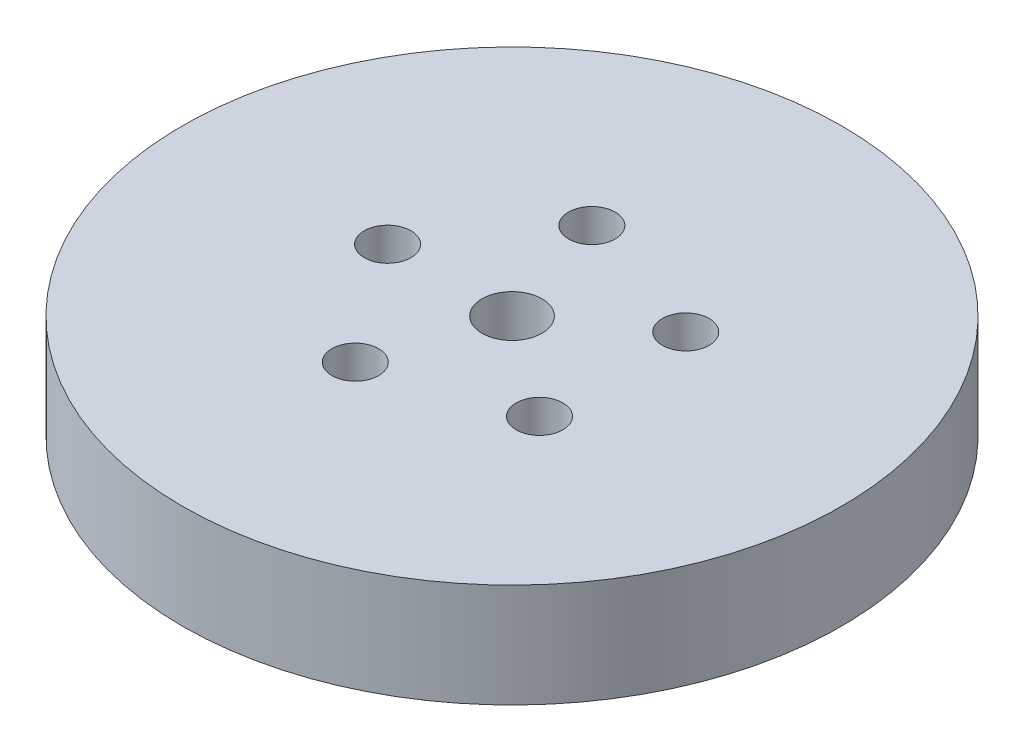
ISO-10303-21;
HEADER;
FILE_DESCRIPTION(('STEP AP214'),'2;1');
FILE_NAME('part.step','',(''),(''),'','','');
FILE_SCHEMA(('AUTOMOTIVE_DESIGN { 1 0 10303 214 1 1 1 1 }'));
ENDSEC;
DATA;
#1=APPLICATION_CONTEXT('core data for automotive mechanical design processes');
#2=APPLICATION_PROTOCOL_DEFINITION('international standard','automotive_design',2000,#1);
#3=PRODUCT_CONTEXT('',#1,'mechanical');
#4=PRODUCT('Part','Part','',(#3));
#5=PRODUCT_RELATED_PRODUCT_CATEGORY('part','',(#4));
#6=PRODUCT_DEFINITION_FORMATION('','',#4);
#7=PRODUCT_DEFINITION_CONTEXT('part definition',#1,'design');
#8=PRODUCT_DEFINITION('design','',#6,#7);
#9=PRODUCT_DEFINITION_SHAPE('','',#8);
#10=(LENGTH_UNIT() NAMED_UNIT(*) SI_UNIT(.MILLI.,.METRE.));
#11=(NAMED_UNIT(*) PLANE_ANGLE_UNIT() SI_UNIT($,.RADIAN.));
#12=(NAMED_UNIT(*) SI_UNIT($,.STERADIAN.) SOLID_ANGLE_UNIT());
#13=UNCERTAINTY_MEASURE_WITH_UNIT(LENGTH_MEASURE(1.E-05),#10,'distance_accuracy_value','');
#14=(GEOMETRIC_REPRESENTATION_CONTEXT(3) GLOBAL_UNCERTAINTY_ASSIGNED_CONTEXT((#13)) GLOBAL_UNIT_ASSIGNED_CONTEXT((#10,
#11,#12)) REPRESENTATION_CONTEXT('',''));
#15=CARTESIAN_POINT('',(0.,0.,0.));
#16=DIRECTION('',(0.,0.,1.));
#17=DIRECTION('',(1.,0.,0.));
#18=AXIS2_PLACEMENT_3D('',#15,#16,#17);
#19=CARTESIAN_POINT('',(0.,26.,0.));
#20=DIRECTION('',(0.,-1.,0.));
#21=DIRECTION('',(0.,0.,-1.));
#22=AXIS2_PLACEMENT_3D('',#19,#20,#21);
#23=CYLINDRICAL_SURFACE('',#22,82.5);
#24=CARTESIAN_POINT('',(0.,26.,0.));
#25=DIRECTION('',(0.,1.,0.));
#26=DIRECTION('',(0.,0.,1.));
#27=AXIS2_PLACEMENT_3D('',#24,#25,#26);
#28=CIRCLE('',#27,82.5);
#29=CARTESIAN_POINT('',(0.,26.,-82.5));
#30=VERTEX_POINT('',#29);
#31=EDGE_CURVE('E10',#30,#30,#28,.T.);
#32=CARTESIAN_POINT('',(0.,0.,0.));
#33=DIRECTION('',(0.,1.,0.));
#34=DIRECTION('',(0.,0.,1.));
#35=AXIS2_PLACEMENT_3D('',#32,#33,#34);
#36=CIRCLE('',#35,82.5);
#37=CARTESIAN_POINT('',(0.,0.,-82.5));
#38=VERTEX_POINT('',#37);
#39=EDGE_CURVE('E37',#38,#38,#36,.T.);
#40=CARTESIAN_POINT('',(0.,26.,-82.5));
#41=CARTESIAN_POINT('',(0.,25.7291666666667,-82.5));
#42=CARTESIAN_POINT('',(0.,25.4583333333333,-82.5));
#43=CARTESIAN_POINT('',(0.,24.9166666666667,-82.5));
#44=CARTESIAN_POINT('',(0.,24.6458333333333,-82.5));
#45=CARTESIAN_POINT('',(0.,24.1041666666667,-82.5));
#46=CARTESIAN_POINT('',(0.,23.8333333333333,-82.5));
#47=CARTESIAN_POINT('',(0.,23.2916666666667,-82.5));
#48=CARTESIAN_POINT('',(0.,23.0208333333333,-82.5));
#49=CARTESIAN_POINT('',(0.,22.4791666666667,-82.5));
#50=CARTESIAN_POINT('',(0.,22.2083333333333,-82.5));
#51=CARTESIAN_POINT('',(0.,21.6666666666667,-82.5));
#52=CARTESIAN_POINT('',(0.,21.3958333333333,-82.5));
#53=CARTESIAN_POINT('',(0.,20.8541666666667,-82.5));
#54=CARTESIAN_POINT('',(0.,20.5833333333333,-82.5));
#55=CARTESIAN_POINT('',(0.,20.0416666666667,-82.5));
#56=CARTESIAN_POINT('',(0.,19.7708333333333,-82.5));
#57=CARTESIAN_POINT('',(0.,19.2291666666667,-82.5));
#58=CARTESIAN_POINT('',(0.,18.9583333333333,-82.5));
#59=CARTESIAN_POINT('',(0.,18.4166666666667,-82.5));
#60=CARTESIAN_POINT('',(0.,18.1458333333333,-82.5));
#61=CARTESIAN_POINT('',(0.,17.6041666666667,-82.5));
#62=CARTESIAN_POINT('',(0.,17.3333333333333,-82.5));
#63=CARTESIAN_POINT('',(0.,16.7916666666667,-82.5));
#64=CARTESIAN_POINT('',(0.,16.5208333333333,-82.5));
#65=CARTESIAN_POINT('',(0.,15.9791666666667,-82.5));
#66=CARTESIAN_POINT('',(0.,15.7083333333333,-82.5));
#67=CARTESIAN_POINT('',(0.,15.1666666666667,-82.5));
#68=CARTESIAN_POINT('',(0.,14.8958333333333,-82.5));
#69=CARTESIAN_POINT('',(0.,14.3541666666667,-82.5));
#70=CARTESIAN_POINT('',(0.,14.0833333333333,-82.5));
#71=CARTESIAN_POINT('',(0.,13.5416666666667,-82.5));
#72=CARTESIAN_POINT('',(0.,13.2708333333333,-82.5));
#73=CARTESIAN_POINT('',(0.,12.7291666666667,-82.5));
#74=CARTESIAN_POINT('',(0.,12.4583333333333,-82.5));
#75=CARTESIAN_POINT('',(0.,11.9166666666667,-82.5));
#76=CARTESIAN_POINT('',(0.,11.6458333333333,-82.5));
#77=CARTESIAN_POINT('',(0.,11.1041666666667,-82.5));
#78=CARTESIAN_POINT('',(0.,10.8333333333333,-82.5));
#79=CARTESIAN_POINT('',(0.,10.2916666666667,-82.5));
#80=CARTESIAN_POINT('',(0.,10.0208333333333,-82.5));
#81=CARTESIAN_POINT('',(0.,9.47916666666667,-82.5));
#82=CARTESIAN_POINT('',(0.,9.20833333333333,-82.5));
#83=CARTESIAN_POINT('',(0.,8.66666666666667,-82.5));
#84=CARTESIAN_POINT('',(0.,8.39583333333333,-82.5));
#85=CARTESIAN_POINT('',(0.,7.85416666666667,-82.5));
#86=CARTESIAN_POINT('',(0.,7.58333333333333,-82.5));
#87=CARTESIAN_POINT('',(0.,7.04166666666667,-82.5));
#88=CARTESIAN_POINT('',(0.,6.77083333333333,-82.5));
#89=CARTESIAN_POINT('',(0.,6.22916666666667,-82.5));
#90=CARTESIAN_POINT('',(0.,5.95833333333333,-82.5));
#91=CARTESIAN_POINT('',(0.,5.41666666666667,-82.5));
#92=CARTESIAN_POINT('',(0.,5.14583333333333,-82.5));
#93=CARTESIAN_POINT('',(0.,4.60416666666667,-82.5));
#94=CARTESIAN_POINT('',(0.,4.33333333333333,-82.5));
#95=CARTESIAN_POINT('',(0.,3.79166666666667,-82.5));
#96=CARTESIAN_POINT('',(0.,3.52083333333333,-82.5));
#97=CARTESIAN_POINT('',(0.,2.97916666666667,-82.5));
#98=CARTESIAN_POINT('',(0.,2.70833333333333,-82.5));
#99=CARTESIAN_POINT('',(0.,2.16666666666667,-82.5));
#100=CARTESIAN_POINT('',(0.,1.89583333333333,-82.5));
#101=CARTESIAN_POINT('',(0.,1.35416666666667,-82.5));
#102=CARTESIAN_POINT('',(0.,1.08333333333333,-82.5));
#103=CARTESIAN_POINT('',(0.,0.541666666666667,-82.5));
#104=CARTESIAN_POINT('',(0.,0.270833333333334,-82.5));
#105=CARTESIAN_POINT('',(0.,0.,-82.5));
#106=B_SPLINE_CURVE_WITH_KNOTS('',3,(#40,#41,#42,#43,#44,#45,#46,#47,#48,#49,#50,#51,#52,#53,
#54,#55,#56,#57,#58,#59,#60,#61,#62,#63,#64,#65,#66,#67,#68,#69,#70,#71,#72,#73,#74,#75,#76,#77,
#78,#79,#80,#81,#82,#83,#84,#85,#86,#87,#88,#89,#90,#91,#92,#93,#94,#95,#96,#97,#98,#99,#100,
#101,#102,#103,#104,#105),.UNSPECIFIED.,.F.,.F.,(4,2,2,2,2,2,2,2,2,2,2,2,2,2,2,2,2,2,2,2,2,2,2,
2,2,2,2,2,2,2,2,2,4),(0.,0.812500000000001,1.625,2.4375,3.25,4.0625,4.875,5.6875,6.5,7.3125,
8.125,8.9375,9.75,10.5625,11.375,12.1875,13.,13.8125,14.625,15.4375,16.25,17.0625,17.875,
18.6875,19.5,20.3125,21.125,21.9375,22.75,23.5625,24.375,25.1875,26.),.UNSPECIFIED.);
#107=EDGE_CURVE('BSEAM40',#30,#38,#106,.T.);
#108=ORIENTED_EDGE('',*,*,#31,.F.);
#109=ORIENTED_EDGE('',*,*,#39,.T.);
#110=ORIENTED_EDGE('',*,*,#107,.T.);
#111=ORIENTED_EDGE('',*,*,#107,.F.);
#112=EDGE_LOOP('',(#108,#110,#109,#111));
#113=FACE_BOUND('',#112,.T.);
#114=ADVANCED_FACE('F40',(#113),#23,.T.);
#115=CARTESIAN_POINT('',(0.,26.,0.));
#116=DIRECTION('',(0.,1.,0.));
#117=DIRECTION('',(0.,0.,1.));
#118=AXIS2_PLACEMENT_3D('',#115,#116,#117);
#119=PLANE('',#118);
#120=CARTESIAN_POINT('',(-9.62234964400374,26.,-29.6145470882933));
#121=DIRECTION('',(0.,1.,0.));
#122=DIRECTION('',(-0.95105651629515,0.,0.309016994374958));
#123=AXIS2_PLACEMENT_3D('',#120,#121,#122);
#124=CIRCLE('',#123,5.84834959047401);
#125=CARTESIAN_POINT('',(-15.1844606315961,26.,-27.807307675791));
#126=VERTEX_POINT('',#125);
#127=EDGE_CURVE('E70',#126,#126,#124,.T.);
#128=ORIENTED_EDGE('',*,*,#127,.F.);
#129=EDGE_LOOP('',(#128));
#130=FACE_BOUND('',#129,.T.);
#131=CARTESIAN_POINT('',(25.1916384196362,26.,-18.3027966619998));
#132=DIRECTION('',(0.,1.,0.));
#133=DIRECTION('',(-0.58778525229248,0.,-0.809016994374942));
#134=AXIS2_PLACEMENT_3D('',#131,#132,#133);
#135=CIRCLE('',#134,5.84834959047401);
#136=CARTESIAN_POINT('',(21.7540647801048,26.,-23.034210869739));
#137=VERTEX_POINT('',#136);
#138=EDGE_CURVE('E71',#137,#137,#135,.T.);
#139=ORIENTED_EDGE('',*,*,#138,.F.);
#140=EDGE_LOOP('',(#139));
#141=FACE_BOUND('',#140,.T.);
#142=CARTESIAN_POINT('',(25.1916384196365,26.,18.3027966619994));
#143=DIRECTION('',(0.,1.,0.));
#144=DIRECTION('',(0.587785252292469,0.,-0.809016994374951));
#145=AXIS2_PLACEMENT_3D('',#142,#143,#144);
#146=CIRCLE('',#145,5.84834959047401);
#147=CARTESIAN_POINT('',(28.6292120591678,26.,13.5713824542602));
#148=VERTEX_POINT('',#147);
#149=EDGE_CURVE('E78',#148,#148,#146,.T.);
#150=ORIENTED_EDGE('',*,*,#149,.F.);
#151=EDGE_LOOP('',(#150));
#152=FACE_BOUND('',#151,.T.);
#153=CARTESIAN_POINT('',(-9.62234964400332,26.,29.6145470882935));
#154=DIRECTION('',(0.,1.,0.));
#155=DIRECTION('',(0.951056516295155,0.,0.309016994374945));
#156=AXIS2_PLACEMENT_3D('',#153,#154,#155);
#157=CIRCLE('',#156,5.84834959047401);
#158=CARTESIAN_POINT('',(-4.06023865641092,26.,31.4217865007957));
#159=VERTEX_POINT('',#158);
#160=EDGE_CURVE('E61',#159,#159,#157,.T.);
#161=ORIENTED_EDGE('',*,*,#160,.F.);
#162=EDGE_LOOP('',(#161));
#163=FACE_BOUND('',#162,.T.);
#164=CARTESIAN_POINT('',(-31.1385775512659,26.,0.));
#165=DIRECTION('',(0.,1.,0.));
#166=DIRECTION('',(0.,0.,1.));
#167=AXIS2_PLACEMENT_3D('',#164,#165,#166);
#168=CIRCLE('',#167,5.84834959047401);
#169=CARTESIAN_POINT('',(-31.1385775512659,26.,5.84834959047401));
#170=VERTEX_POINT('',#169);
#171=EDGE_CURVE('E54',#170,#170,#168,.T.);
#172=ORIENTED_EDGE('',*,*,#171,.F.);
#173=EDGE_LOOP('',(#172));
#174=FACE_BOUND('',#173,.T.);
#175=CARTESIAN_POINT('',(0.,26.,0.));
#176=DIRECTION('',(0.,1.,0.));
#177=DIRECTION('',(0.,0.,1.));
#178=AXIS2_PLACEMENT_3D('',#175,#176,#177);
#179=CIRCLE('',#178,7.5);
#180=CARTESIAN_POINT('',(0.,26.,-7.5));
#181=VERTEX_POINT('',#180);
#182=EDGE_CURVE('E50',#181,#181,#179,.T.);
#183=ORIENTED_EDGE('',*,*,#182,.F.);
#184=EDGE_LOOP('',(#183));
#185=FACE_BOUND('',#184,.T.);
#186=ORIENTED_EDGE('',*,*,#31,.T.);
#187=EDGE_LOOP('',(#186));
#188=FACE_BOUND('',#187,.T.);
#189=ADVANCED_FACE('F94',(#130,#141,#152,#163,#174,#185,#188),#119,.T.);
#190=CARTESIAN_POINT('',(0.,0.,0.));
#191=DIRECTION('',(0.,1.,0.));
#192=DIRECTION('',(0.,0.,1.));
#193=AXIS2_PLACEMENT_3D('',#190,#191,#192);
#194=PLANE('',#193);
#195=CARTESIAN_POINT('',(0.,0.,0.));
#196=DIRECTION('',(0.,1.,0.));
#197=DIRECTION('',(0.,0.,1.));
#198=AXIS2_PLACEMENT_3D('',#195,#196,#197);
#199=CIRCLE('',#198,7.5);
#200=CARTESIAN_POINT('',(0.,0.,-7.5));
#201=VERTEX_POINT('',#200);
#202=EDGE_CURVE('E47',#201,#201,#199,.T.);
#203=ORIENTED_EDGE('',*,*,#202,.T.);
#204=EDGE_LOOP('',(#203));
#205=FACE_BOUND('',#204,.T.);
#206=ORIENTED_EDGE('',*,*,#39,.F.);
#207=EDGE_LOOP('',(#206));
#208=FACE_BOUND('',#207,.T.);
#209=ADVANCED_FACE('F100',(#205,#208),#194,.F.);
#210=CARTESIAN_POINT('',(0.,26.,0.));
#211=DIRECTION('',(0.,-1.,0.));
#212=DIRECTION('',(0.,0.,-1.));
#213=AXIS2_PLACEMENT_3D('',#210,#211,#212);
#214=CYLINDRICAL_SURFACE('',#213,7.5);
#215=CARTESIAN_POINT('',(0.,26.,-7.5));
#216=CARTESIAN_POINT('',(0.,25.7291666666667,-7.5));
#217=CARTESIAN_POINT('',(0.,25.4583333333333,-7.5));
#218=CARTESIAN_POINT('',(0.,24.9166666666667,-7.5));
#219=CARTESIAN_POINT('',(0.,24.6458333333333,-7.5));
#220=CARTESIAN_POINT('',(0.,24.1041666666667,-7.5));
#221=CARTESIAN_POINT('',(0.,23.8333333333333,-7.5));
#222=CARTESIAN_POINT('',(0.,23.2916666666667,-7.5));
#223=CARTESIAN_POINT('',(0.,23.0208333333333,-7.5));
#224=CARTESIAN_POINT('',(0.,22.4791666666667,-7.5));
#225=CARTESIAN_POINT('',(0.,22.2083333333333,-7.5));
#226=CARTESIAN_POINT('',(0.,21.6666666666667,-7.5));
#227=CARTESIAN_POINT('',(0.,21.3958333333333,-7.5));
#228=CARTESIAN_POINT('',(0.,20.8541666666667,-7.5));
#229=CARTESIAN_POINT('',(0.,20.5833333333333,-7.5));
#230=CARTESIAN_POINT('',(0.,20.0416666666667,-7.5));
#231=CARTESIAN_POINT('',(0.,19.7708333333333,-7.5));
#232=CARTESIAN_POINT('',(0.,19.2291666666667,-7.5));
#233=CARTESIAN_POINT('',(0.,18.9583333333333,-7.5));
#234=CARTESIAN_POINT('',(0.,18.4166666666667,-7.5));
#235=CARTESIAN_POINT('',(0.,18.1458333333333,-7.5));
#236=CARTESIAN_POINT('',(0.,17.6041666666667,-7.5));
#237=CARTESIAN_POINT('',(0.,17.3333333333333,-7.5));
#238=CARTESIAN_POINT('',(0.,16.7916666666667,-7.5));
#239=CARTESIAN_POINT('',(0.,16.5208333333333,-7.5));
#240=CARTESIAN_POINT('',(0.,15.9791666666667,-7.5));
#241=CARTESIAN_POINT('',(0.,15.7083333333333,-7.5));
#242=CARTESIAN_POINT('',(0.,15.1666666666667,-7.5));
#243=CARTESIAN_POINT('',(0.,14.8958333333333,-7.5));
#244=CARTESIAN_POINT('',(0.,14.3541666666667,-7.5));
#245=CARTESIAN_POINT('',(0.,14.0833333333333,-7.5));
#246=CARTESIAN_POINT('',(0.,13.5416666666667,-7.5));
#247=CARTESIAN_POINT('',(0.,13.2708333333333,-7.5));
#248=CARTESIAN_POINT('',(0.,12.7291666666667,-7.5));
#249=CARTESIAN_POINT('',(0.,12.4583333333333,-7.5));
#250=CARTESIAN_POINT('',(0.,11.9166666666667,-7.5));
#251=CARTESIAN_POINT('',(0.,11.6458333333333,-7.5));
#252=CARTESIAN_POINT('',(0.,11.1041666666667,-7.5));
#253=CARTESIAN_POINT('',(0.,10.8333333333333,-7.5));
#254=CARTESIAN_POINT('',(0.,10.2916666666667,-7.5));
#255=CARTESIAN_POINT('',(0.,10.0208333333333,-7.5));
#256=CARTESIAN_POINT('',(0.,9.47916666666667,-7.5));
#257=CARTESIAN_POINT('',(0.,9.20833333333333,-7.5));
#258=CARTESIAN_POINT('',(0.,8.66666666666667,-7.5));
#259=CARTESIAN_POINT('',(0.,8.39583333333333,-7.5));
#260=CARTESIAN_POINT('',(0.,7.85416666666667,-7.5));
#261=CARTESIAN_POINT('',(0.,7.58333333333333,-7.5));
#262=CARTESIAN_POINT('',(0.,7.04166666666667,-7.5));
#263=CARTESIAN_POINT('',(0.,6.77083333333333,-7.5));
#264=CARTESIAN_POINT('',(0.,6.22916666666667,-7.5));
#265=CARTESIAN_POINT('',(0.,5.95833333333333,-7.5));
#266=CARTESIAN_POINT('',(0.,5.41666666666667,-7.5));
#267=CARTESIAN_POINT('',(0.,5.14583333333333,-7.5));
#268=CARTESIAN_POINT('',(0.,4.60416666666667,-7.5));
#269=CARTESIAN_POINT('',(0.,4.33333333333333,-7.5));
#270=CARTESIAN_POINT('',(0.,3.79166666666667,-7.5));
#271=CARTESIAN_POINT('',(0.,3.52083333333333,-7.5));
#272=CARTESIAN_POINT('',(0.,2.97916666666667,-7.5));
#273=CARTESIAN_POINT('',(0.,2.70833333333333,-7.5));
#274=CARTESIAN_POINT('',(0.,2.16666666666667,-7.5));
#275=CARTESIAN_POINT('',(0.,1.89583333333333,-7.5));
#276=CARTESIAN_POINT('',(0.,1.35416666666667,-7.5));
#277=CARTESIAN_POINT('',(0.,1.08333333333333,-7.5));
#278=CARTESIAN_POINT('',(0.,0.541666666666667,-7.5));
#279=CARTESIAN_POINT('',(0.,0.270833333333334,-7.5));
#280=CARTESIAN_POINT('',(0.,0.,-7.5));
#281=B_SPLINE_CURVE_WITH_KNOTS('',3,(#215,#216,#217,#218,#219,#220,#221,#222,#223,#224,#225,
#226,#227,#228,#229,#230,#231,#232,#233,#234,#235,#236,#237,#238,#239,#240,#241,#242,#243,#244,
#245,#246,#247,#248,#249,#250,#251,#252,#253,#254,#255,#256,#257,#258,#259,#260,#261,#262,#263,
#264,#265,#266,#267,#268,#269,#270,#271,#272,#273,#274,#275,#276,#277,#278,#279,#280),
.UNSPECIFIED.,.F.,.F.,(4,2,2,2,2,2,2,2,2,2,2,2,2,2,2,2,2,2,2,2,2,2,2,2,2,2,2,2,2,2,2,2,4),(0.,
0.812499999999997,1.625,2.4375,3.25,4.0625,4.875,5.6875,6.5,7.3125,8.125,8.93749999999999,
9.74999999999999,10.5625,11.375,12.1875,13.,13.8125,14.625,15.4375,16.25,17.0625,17.875,18.6875,
19.5,20.3125,21.125,21.9375,22.75,23.5625,24.375,25.1875,26.),.UNSPECIFIED.);
#282=EDGE_CURVE('BSEAM106',#181,#201,#281,.T.);
#283=ORIENTED_EDGE('',*,*,#182,.T.);
#284=ORIENTED_EDGE('',*,*,#202,.F.);
#285=ORIENTED_EDGE('',*,*,#282,.T.);
#286=ORIENTED_EDGE('',*,*,#282,.F.);
#287=EDGE_LOOP('',(#283,#285,#284,#286));
#288=FACE_BOUND('',#287,.T.);
#289=ADVANCED_FACE('F106',(#288),#214,.F.);
#290=CARTESIAN_POINT('',(-31.1385775512659,4.80085496877086,0.));
#291=DIRECTION('',(0.,1.,0.));
#292=DIRECTION('',(0.,0.,1.));
#293=AXIS2_PLACEMENT_3D('',#290,#291,#292);
#294=CYLINDRICAL_SURFACE('',#293,5.84834959047401);
#295=CARTESIAN_POINT('',(-31.1385775512659,4.80085496877086,0.));
#296=DIRECTION('',(0.,1.,0.));
#297=DIRECTION('',(0.,0.,1.));
#298=AXIS2_PLACEMENT_3D('',#295,#296,#297);
#299=CIRCLE('',#298,5.84834959047401);
#300=CARTESIAN_POINT('',(-31.1385775512659,4.80085496877086,5.84834959047401));
#301=VERTEX_POINT('',#300);
#302=EDGE_CURVE('E55',#301,#301,#299,.T.);
#303=ORIENTED_EDGE('',*,*,#302,.F.);
#304=EDGE_LOOP('',(#303));
#305=FACE_BOUND('',#304,.T.);
#306=ORIENTED_EDGE('',*,*,#171,.T.);
#307=EDGE_LOOP('',(#306));
#308=FACE_BOUND('',#307,.T.);
#309=ADVANCED_FACE('F108',(#305,#308),#294,.F.);
#310=CARTESIAN_POINT('',(-31.1385775512659,4.80085496877086,0.));
#311=DIRECTION('',(0.,1.,0.));
#312=DIRECTION('',(0.,0.,1.));
#313=AXIS2_PLACEMENT_3D('',#310,#311,#312);
#314=PLANE('',#313);
#315=ORIENTED_EDGE('',*,*,#302,.T.);
#316=EDGE_LOOP('',(#315));
#317=FACE_BOUND('',#316,.T.);
#318=ADVANCED_FACE('F138',(#317),#314,.T.);
#319=CARTESIAN_POINT('',(-9.62234964400332,4.80085496877086,29.6145470882935));
#320=DIRECTION('',(0.,1.,0.));
#321=DIRECTION('',(0.,0.,1.));
#322=AXIS2_PLACEMENT_3D('',#319,#320,#321);
#323=CYLINDRICAL_SURFACE('',#322,5.84834959047401);
#324=CARTESIAN_POINT('',(-9.62234964400332,4.80085496877086,29.6145470882935));
#325=DIRECTION('',(0.,1.,0.));
#326=DIRECTION('',(0.951056516295155,0.,0.309016994374945));
#327=AXIS2_PLACEMENT_3D('',#324,#325,#326);
#328=CIRCLE('',#327,5.84834959047401);
#329=CARTESIAN_POINT('',(-4.06023865641092,4.80085496877086,31.4217865007957));
#330=VERTEX_POINT('',#329);
#331=EDGE_CURVE('E59',#330,#330,#328,.T.);
#332=ORIENTED_EDGE('',*,*,#331,.F.);
#333=EDGE_LOOP('',(#332));
#334=FACE_BOUND('',#333,.T.);
#335=ORIENTED_EDGE('',*,*,#160,.T.);
#336=EDGE_LOOP('',(#335));
#337=FACE_BOUND('',#336,.T.);
#338=ADVANCED_FACE('F150',(#334,#337),#323,.F.);
#339=CARTESIAN_POINT('',(-9.62234964400332,4.80085496877086,29.6145470882935));
#340=DIRECTION('',(0.,1.,0.));
#341=DIRECTION('',(0.951056516295155,0.,0.309016994374945));
#342=AXIS2_PLACEMENT_3D('',#339,#340,#341);
#343=PLANE('',#342);
#344=ORIENTED_EDGE('',*,*,#331,.T.);
#345=EDGE_LOOP('',(#344));
#346=FACE_BOUND('',#345,.T.);
#347=ADVANCED_FACE('F89',(#346),#343,.T.);
#348=CARTESIAN_POINT('',(25.1916384196365,4.80085496877086,18.3027966619994));
#349=DIRECTION('',(0.,1.,0.));
#350=DIRECTION('',(0.,0.,1.));
#351=AXIS2_PLACEMENT_3D('',#348,#349,#350);
#352=CYLINDRICAL_SURFACE('',#351,5.84834959047401);
#353=CARTESIAN_POINT('',(25.1916384196365,4.80085496877086,18.3027966619994));
#354=DIRECTION('',(0.,1.,0.));
#355=DIRECTION('',(0.587785252292469,0.,-0.809016994374951));
#356=AXIS2_PLACEMENT_3D('',#353,#354,#355);
#357=CIRCLE('',#356,5.84834959047401);
#358=CARTESIAN_POINT('',(28.6292120591678,4.80085496877086,13.5713824542602));
#359=VERTEX_POINT('',#358);
#360=EDGE_CURVE('E63',#359,#359,#357,.T.);
#361=ORIENTED_EDGE('',*,*,#360,.F.);
#362=EDGE_LOOP('',(#361));
#363=FACE_BOUND('',#362,.T.);
#364=ORIENTED_EDGE('',*,*,#149,.T.);
#365=EDGE_LOOP('',(#364));
#366=FACE_BOUND('',#365,.T.);
#367=ADVANCED_FACE('F87',(#363,#366),#352,.F.);
#368=CARTESIAN_POINT('',(25.1916384196365,4.80085496877086,18.3027966619994));
#369=DIRECTION('',(0.,1.,0.));
#370=DIRECTION('',(0.587785252292469,0.,-0.809016994374951));
#371=AXIS2_PLACEMENT_3D('',#368,#369,#370);
#372=PLANE('',#371);
#373=ORIENTED_EDGE('',*,*,#360,.T.);
#374=EDGE_LOOP('',(#373));
#375=FACE_BOUND('',#374,.T.);
#376=ADVANCED_FACE('F84',(#375),#372,.T.);
#377=CARTESIAN_POINT('',(25.1916384196362,4.80085496877086,-18.3027966619998));
#378=DIRECTION('',(0.,1.,0.));
#379=DIRECTION('',(0.,0.,1.));
#380=AXIS2_PLACEMENT_3D('',#377,#378,#379);
#381=CYLINDRICAL_SURFACE('',#380,5.84834959047401);
#382=CARTESIAN_POINT('',(25.1916384196362,4.80085496877086,-18.3027966619998));
#383=DIRECTION('',(0.,1.,0.));
#384=DIRECTION('',(-0.58778525229248,0.,-0.809016994374942));
#385=AXIS2_PLACEMENT_3D('',#382,#383,#384);
#386=CIRCLE('',#385,5.84834959047401);
#387=CARTESIAN_POINT('',(21.7540647801048,4.80085496877086,-23.034210869739));
#388=VERTEX_POINT('',#387);
#389=EDGE_CURVE('E76',#388,#388,#386,.T.);
#390=ORIENTED_EDGE('',*,*,#389,.F.);
#391=EDGE_LOOP('',(#390));
#392=FACE_BOUND('',#391,.T.);
#393=ORIENTED_EDGE('',*,*,#138,.T.);
#394=EDGE_LOOP('',(#393));
#395=FACE_BOUND('',#394,.T.);
#396=ADVANCED_FACE('F185',(#392,#395),#381,.F.);
#397=CARTESIAN_POINT('',(25.1916384196362,4.80085496877086,-18.3027966619998));
#398=DIRECTION('',(0.,1.,0.));
#399=DIRECTION('',(-0.58778525229248,0.,-0.809016994374942));
#400=AXIS2_PLACEMENT_3D('',#397,#398,#399);
#401=PLANE('',#400);
#402=ORIENTED_EDGE('',*,*,#389,.T.);
#403=EDGE_LOOP('',(#402));
#404=FACE_BOUND('',#403,.T.);
#405=ADVANCED_FACE('F189',(#404),#401,.T.);
#406=CARTESIAN_POINT('',(-9.62234964400374,4.80085496877086,-29.6145470882933));
#407=DIRECTION('',(0.,1.,0.));
#408=DIRECTION('',(0.,0.,1.));
#409=AXIS2_PLACEMENT_3D('',#406,#407,#408);
#410=CYLINDRICAL_SURFACE('',#409,5.84834959047401);
#411=CARTESIAN_POINT('',(-9.62234964400374,4.80085496877086,-29.6145470882933));
#412=DIRECTION('',(0.,1.,0.));
#413=DIRECTION('',(-0.95105651629515,0.,0.309016994374958));
#414=AXIS2_PLACEMENT_3D('',#411,#412,#413);
#415=CIRCLE('',#414,5.84834959047401);
#416=CARTESIAN_POINT('',(-15.1844606315961,4.80085496877086,-27.807307675791));
#417=VERTEX_POINT('',#416);
#418=EDGE_CURVE('E69',#417,#417,#415,.T.);
#419=ORIENTED_EDGE('',*,*,#418,.F.);
#420=EDGE_LOOP('',(#419));
#421=FACE_BOUND('',#420,.T.);
#422=ORIENTED_EDGE('',*,*,#127,.T.);
#423=EDGE_LOOP('',(#422));
#424=FACE_BOUND('',#423,.T.);
#425=ADVANCED_FACE('F200',(#421,#424),#410,.F.);
#426=CARTESIAN_POINT('',(-9.62234964400374,4.80085496877086,-29.6145470882933));
#427=DIRECTION('',(0.,1.,0.));
#428=DIRECTION('',(-0.95105651629515,0.,0.309016994374958));
#429=AXIS2_PLACEMENT_3D('',#426,#427,#428);
#430=PLANE('',#429);
#431=ORIENTED_EDGE('',*,*,#418,.T.);
#432=EDGE_LOOP('',(#431));
#433=FACE_BOUND('',#432,.T.);
#434=ADVANCED_FACE('F208',(#433),#430,.T.);
#435=CLOSED_SHELL('',(#114,#189,#209,#289,#309,#318,#338,#347,#367,#376,#396,#405,#425,#434));
#436=MANIFOLD_SOLID_BREP('B2',#435);
#437=ADVANCED_BREP_SHAPE_REPRESENTATION('',(#18,#436),#14);
#438=SHAPE_DEFINITION_REPRESENTATION(#9,#437);
ENDSEC;
END-ISO-10303-21;
